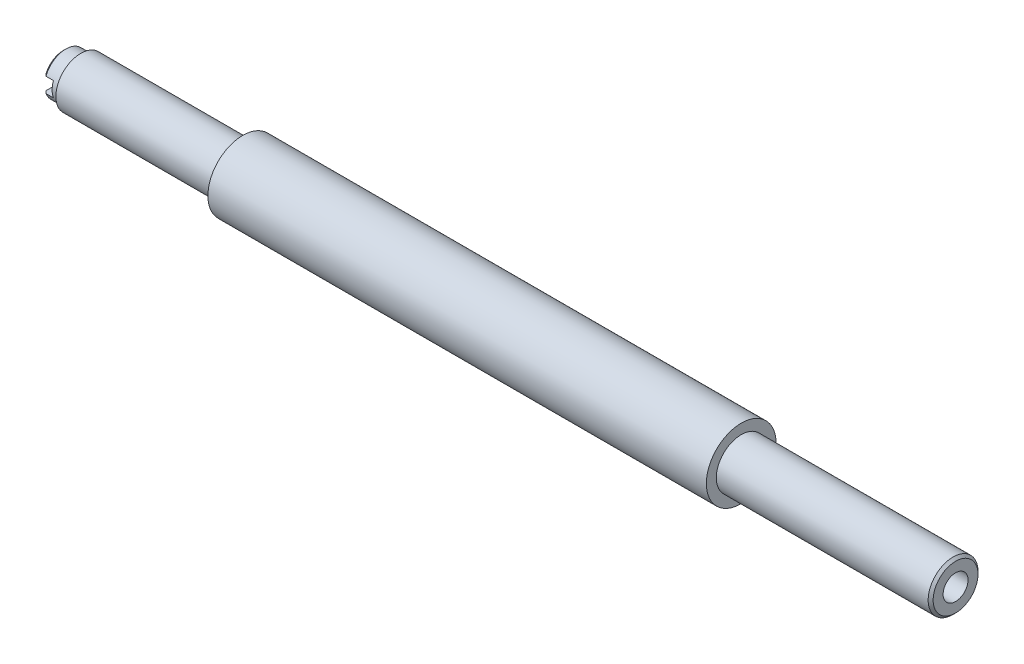
ISO-10303-21;
HEADER;
FILE_DESCRIPTION(('STEP AP214'),'2;1');
FILE_NAME('part.step','',(''),(''),'','','');
FILE_SCHEMA(('AUTOMOTIVE_DESIGN { 1 0 10303 214 1 1 1 1 }'));
ENDSEC;
DATA;
#1=APPLICATION_CONTEXT('core data for automotive mechanical design processes');
#2=APPLICATION_PROTOCOL_DEFINITION('international standard','automotive_design',2000,#1);
#3=PRODUCT_CONTEXT('',#1,'mechanical');
#4=PRODUCT('Part','Part','',(#3));
#5=PRODUCT_RELATED_PRODUCT_CATEGORY('part','',(#4));
#6=PRODUCT_DEFINITION_FORMATION('','',#4);
#7=PRODUCT_DEFINITION_CONTEXT('part definition',#1,'design');
#8=PRODUCT_DEFINITION('design','',#6,#7);
#9=PRODUCT_DEFINITION_SHAPE('','',#8);
#10=(LENGTH_UNIT() NAMED_UNIT(*) SI_UNIT(.MILLI.,.METRE.));
#11=(NAMED_UNIT(*) PLANE_ANGLE_UNIT() SI_UNIT($,.RADIAN.));
#12=(NAMED_UNIT(*) SI_UNIT($,.STERADIAN.) SOLID_ANGLE_UNIT());
#13=UNCERTAINTY_MEASURE_WITH_UNIT(LENGTH_MEASURE(1.E-05),#10,'distance_accuracy_value','');
#14=(GEOMETRIC_REPRESENTATION_CONTEXT(3) GLOBAL_UNCERTAINTY_ASSIGNED_CONTEXT((#13)) GLOBAL_UNIT_ASSIGNED_CONTEXT((#10,
#11,#12)) REPRESENTATION_CONTEXT('',''));
#15=CARTESIAN_POINT('',(0.,0.,0.));
#16=DIRECTION('',(0.,0.,1.));
#17=DIRECTION('',(1.,0.,0.));
#18=AXIS2_PLACEMENT_3D('',#15,#16,#17);
#19=CARTESIAN_POINT('',(-32.5,0.,0.));
#20=DIRECTION('',(-1.,0.,0.));
#21=DIRECTION('',(0.,0.,1.));
#22=AXIS2_PLACEMENT_3D('',#19,#20,#21);
#23=CYLINDRICAL_SURFACE('',#22,4.25);
#24=CARTESIAN_POINT('',(-32.5,0.,0.));
#25=DIRECTION('',(-1.,0.,0.));
#26=DIRECTION('',(0.,0.,1.));
#27=AXIS2_PLACEMENT_3D('',#24,#25,#26);
#28=CIRCLE('',#27,4.25);
#29=CARTESIAN_POINT('',(-32.5,0.,4.25));
#30=VERTEX_POINT('',#29);
#31=EDGE_CURVE('E130',#30,#30,#28,.T.);
#32=ORIENTED_EDGE('',*,*,#31,.T.);
#33=EDGE_LOOP('',(#32));
#34=FACE_BOUND('',#33,.T.);
#35=DIRECTION('',(-1.,0.,0.));
#36=VECTOR('',#35,1.);
#37=CARTESIAN_POINT('',(-32.5,-1.5,3.97649343014672));
#38=LINE('',#37,#36);
#39=CARTESIAN_POINT('',(-34.,-1.5,3.97649343014672));
#40=VERTEX_POINT('',#39);
#41=CARTESIAN_POINT('',(-35.5,-1.5,3.97649343014672));
#42=VERTEX_POINT('',#41);
#43=EDGE_CURVE('E278',#40,#42,#38,.T.);
#44=ORIENTED_EDGE('',*,*,#43,.T.);
#45=CARTESIAN_POINT('',(-35.5,0.,0.));
#46=DIRECTION('',(1.,0.,0.));
#47=DIRECTION('',(0.,0.,-1.));
#48=AXIS2_PLACEMENT_3D('',#45,#46,#47);
#49=CIRCLE('',#48,4.25);
#50=CARTESIAN_POINT('',(-35.5,1.5,3.97649343014672));
#51=VERTEX_POINT('',#50);
#52=EDGE_CURVE('E47',#42,#51,#49,.T.);
#53=ORIENTED_EDGE('',*,*,#52,.T.);
#54=DIRECTION('',(-1.,0.,0.));
#55=VECTOR('',#54,1.);
#56=CARTESIAN_POINT('',(-32.5,1.5,3.97649343014672));
#57=LINE('',#56,#55);
#58=CARTESIAN_POINT('',(-34.,1.5,3.97649343014672));
#59=VERTEX_POINT('',#58);
#60=EDGE_CURVE('E100',#51,#59,#57,.F.);
#61=ORIENTED_EDGE('',*,*,#60,.T.);
#62=CARTESIAN_POINT('',(-34.,0.,0.));
#63=DIRECTION('',(-1.,0.,0.));
#64=DIRECTION('',(0.,0.,1.));
#65=AXIS2_PLACEMENT_3D('',#62,#63,#64);
#66=CIRCLE('',#65,4.25);
#67=EDGE_CURVE('E280',#59,#40,#66,.F.);
#68=ORIENTED_EDGE('',*,*,#67,.T.);
#69=EDGE_LOOP('',(#44,#53,#61,#68));
#70=FACE_BOUND('',#69,.T.);
#71=ADVANCED_FACE('F32',(#34,#70),#23,.T.);
#72=CARTESIAN_POINT('',(-36.,0.,0.));
#73=DIRECTION('',(1.,0.,0.));
#74=DIRECTION('',(0.,0.,-1.));
#75=AXIS2_PLACEMENT_3D('',#72,#73,#74);
#76=CYLINDRICAL_SURFACE('',#75,2.5);
#77=CARTESIAN_POINT('',(0.,0.,0.));
#78=DIRECTION('',(1.,0.,0.));
#79=DIRECTION('',(0.,0.,-1.));
#80=AXIS2_PLACEMENT_3D('',#77,#78,#79);
#81=CIRCLE('',#80,2.5);
#82=CARTESIAN_POINT('',(0.,0.,-2.5));
#83=VERTEX_POINT('',#82);
#84=EDGE_CURVE('E118',#83,#83,#81,.T.);
#85=ORIENTED_EDGE('',*,*,#84,.T.);
#86=EDGE_LOOP('',(#85));
#87=FACE_BOUND('',#86,.T.);
#88=DIRECTION('',(1.,0.,0.));
#89=VECTOR('',#88,1.);
#90=CARTESIAN_POINT('',(-36.,-1.5,2.));
#91=LINE('',#90,#89);
#92=CARTESIAN_POINT('',(-34.,-1.5,2.));
#93=VERTEX_POINT('',#92);
#94=CARTESIAN_POINT('',(-36.,-1.5,2.));
#95=VERTEX_POINT('',#94);
#96=EDGE_CURVE('E276',#93,#95,#91,.F.);
#97=ORIENTED_EDGE('',*,*,#96,.F.);
#98=CARTESIAN_POINT('',(-34.,0.,0.));
#99=DIRECTION('',(-1.,0.,0.));
#100=DIRECTION('',(0.,0.,1.));
#101=AXIS2_PLACEMENT_3D('',#98,#99,#100);
#102=CIRCLE('',#101,2.5);
#103=CARTESIAN_POINT('',(-34.,1.5,2.));
#104=VERTEX_POINT('',#103);
#105=EDGE_CURVE('E99',#104,#93,#102,.F.);
#106=ORIENTED_EDGE('',*,*,#105,.F.);
#107=DIRECTION('',(1.,0.,0.));
#108=VECTOR('',#107,1.);
#109=CARTESIAN_POINT('',(-36.,1.5,2.));
#110=LINE('',#109,#108);
#111=CARTESIAN_POINT('',(-36.,1.5,2.));
#112=VERTEX_POINT('',#111);
#113=EDGE_CURVE('E82',#112,#104,#110,.T.);
#114=ORIENTED_EDGE('',*,*,#113,.F.);
#115=CARTESIAN_POINT('',(-36.,0.,0.));
#116=DIRECTION('',(1.,0.,0.));
#117=DIRECTION('',(0.,0.,-1.));
#118=AXIS2_PLACEMENT_3D('',#115,#116,#117);
#119=CIRCLE('',#118,2.5);
#120=EDGE_CURVE('E98',#95,#112,#119,.T.);
#121=ORIENTED_EDGE('',*,*,#120,.F.);
#122=EDGE_LOOP('',(#97,#106,#114,#121));
#123=FACE_BOUND('',#122,.T.);
#124=ADVANCED_FACE('F97',(#87,#123),#76,.F.);
#125=CARTESIAN_POINT('',(-36.,0.,0.));
#126=DIRECTION('',(1.,0.,0.));
#127=DIRECTION('',(0.,0.,-1.));
#128=AXIS2_PLACEMENT_3D('',#125,#126,#127);
#129=PLANE('',#128);
#130=DIRECTION('',(0.,0.,-1.));
#131=VECTOR('',#130,1.);
#132=CARTESIAN_POINT('',(-36.,1.5,0.));
#133=LINE('',#132,#131);
#134=CARTESIAN_POINT('',(-36.,1.5,3.43693177121682));
#135=VERTEX_POINT('',#134);
#136=EDGE_CURVE('E78',#135,#112,#133,.T.);
#137=ORIENTED_EDGE('',*,*,#136,.F.);
#138=CARTESIAN_POINT('',(-36.,0.,0.));
#139=DIRECTION('',(1.,0.,0.));
#140=DIRECTION('',(0.,0.,-1.));
#141=AXIS2_PLACEMENT_3D('',#138,#139,#140);
#142=CIRCLE('',#141,3.74999999999995);
#143=CARTESIAN_POINT('',(-36.,-1.5,3.43693177121682));
#144=VERTEX_POINT('',#143);
#145=EDGE_CURVE('E134',#135,#144,#142,.F.);
#146=ORIENTED_EDGE('',*,*,#145,.T.);
#147=DIRECTION('',(0.,0.,1.));
#148=VECTOR('',#147,1.);
#149=CARTESIAN_POINT('',(-36.,-1.5,0.));
#150=LINE('',#149,#148);
#151=EDGE_CURVE('E90',#95,#144,#150,.T.);
#152=ORIENTED_EDGE('',*,*,#151,.F.);
#153=ORIENTED_EDGE('',*,*,#120,.T.);
#154=EDGE_LOOP('',(#137,#146,#152,#153));
#155=FACE_BOUND('',#154,.T.);
#156=ADVANCED_FACE('F104',(#155),#129,.F.);
#157=CARTESIAN_POINT('',(-36.,0.,0.));
#158=DIRECTION('',(1.,0.,0.));
#159=DIRECTION('',(0.,0.,-1.));
#160=AXIS2_PLACEMENT_3D('',#157,#158,#159);
#161=CYLINDRICAL_SURFACE('',#160,5.);
#162=CARTESIAN_POINT('',(0.,0.,0.));
#163=DIRECTION('',(1.,0.,0.));
#164=DIRECTION('',(0.,0.,-1.));
#165=AXIS2_PLACEMENT_3D('',#162,#163,#164);
#166=CIRCLE('',#165,5.);
#167=CARTESIAN_POINT('',(0.,0.,-5.));
#168=VERTEX_POINT('',#167);
#169=EDGE_CURVE('E109',#168,#168,#166,.T.);
#170=ORIENTED_EDGE('',*,*,#169,.F.);
#171=EDGE_LOOP('',(#170));
#172=FACE_BOUND('',#171,.T.);
#173=CARTESIAN_POINT('',(-32.5,0.,0.));
#174=DIRECTION('',(-1.,0.,0.));
#175=DIRECTION('',(0.,0.,1.));
#176=AXIS2_PLACEMENT_3D('',#173,#174,#175);
#177=CIRCLE('',#176,5.);
#178=CARTESIAN_POINT('',(-32.5,0.,5.));
#179=VERTEX_POINT('',#178);
#180=EDGE_CURVE('E112',#179,#179,#177,.F.);
#181=ORIENTED_EDGE('',*,*,#180,.T.);
#182=EDGE_LOOP('',(#181));
#183=FACE_BOUND('',#182,.T.);
#184=ADVANCED_FACE('F194',(#172,#183),#161,.T.);
#185=CARTESIAN_POINT('',(100.,0.,0.));
#186=DIRECTION('',(-1.,0.,0.));
#187=DIRECTION('',(0.,0.,1.));
#188=AXIS2_PLACEMENT_3D('',#185,#186,#187);
#189=CYLINDRICAL_SURFACE('',#188,7.);
#190=CARTESIAN_POINT('',(100.,0.,0.));
#191=DIRECTION('',(1.,0.,0.));
#192=DIRECTION('',(0.,0.,-1.));
#193=AXIS2_PLACEMENT_3D('',#190,#191,#192);
#194=CIRCLE('',#193,7.);
#195=CARTESIAN_POINT('',(100.,0.,-7.));
#196=VERTEX_POINT('',#195);
#197=EDGE_CURVE('E122',#196,#196,#194,.T.);
#198=ORIENTED_EDGE('',*,*,#197,.F.);
#199=EDGE_LOOP('',(#198));
#200=FACE_BOUND('',#199,.T.);
#201=CARTESIAN_POINT('',(0.,0.,0.));
#202=DIRECTION('',(1.,0.,0.));
#203=DIRECTION('',(0.,0.,-1.));
#204=AXIS2_PLACEMENT_3D('',#201,#202,#203);
#205=CIRCLE('',#204,7.);
#206=CARTESIAN_POINT('',(0.,0.,-7.));
#207=VERTEX_POINT('',#206);
#208=EDGE_CURVE('E119',#207,#207,#205,.T.);
#209=ORIENTED_EDGE('',*,*,#208,.T.);
#210=EDGE_LOOP('',(#209));
#211=FACE_BOUND('',#210,.T.);
#212=ADVANCED_FACE('F34',(#200,#211),#189,.T.);
#213=CARTESIAN_POINT('',(100.,0.,0.));
#214=DIRECTION('',(1.,0.,0.));
#215=DIRECTION('',(0.,0.,-1.));
#216=AXIS2_PLACEMENT_3D('',#213,#214,#215);
#217=PLANE('',#216);
#218=CARTESIAN_POINT('',(100.,0.,0.));
#219=DIRECTION('',(1.,0.,0.));
#220=DIRECTION('',(0.,0.,-1.));
#221=AXIS2_PLACEMENT_3D('',#218,#219,#220);
#222=CIRCLE('',#221,5.);
#223=CARTESIAN_POINT('',(100.,0.,-5.));
#224=VERTEX_POINT('',#223);
#225=EDGE_CURVE('E91',#224,#224,#222,.T.);
#226=ORIENTED_EDGE('',*,*,#225,.F.);
#227=EDGE_LOOP('',(#226));
#228=FACE_BOUND('',#227,.T.);
#229=ORIENTED_EDGE('',*,*,#197,.T.);
#230=EDGE_LOOP('',(#229));
#231=FACE_BOUND('',#230,.T.);
#232=ADVANCED_FACE('F200',(#228,#231),#217,.T.);
#233=CARTESIAN_POINT('',(0.,0.,0.));
#234=DIRECTION('',(1.,0.,0.));
#235=DIRECTION('',(0.,0.,-1.));
#236=AXIS2_PLACEMENT_3D('',#233,#234,#235);
#237=PLANE('',#236);
#238=ORIENTED_EDGE('',*,*,#169,.T.);
#239=EDGE_LOOP('',(#238));
#240=FACE_BOUND('',#239,.T.);
#241=ORIENTED_EDGE('',*,*,#208,.F.);
#242=EDGE_LOOP('',(#241));
#243=FACE_BOUND('',#242,.T.);
#244=ADVANCED_FACE('F197',(#240,#243),#237,.F.);
#245=CARTESIAN_POINT('',(142.5,0.,0.));
#246=DIRECTION('',(1.,0.,0.));
#247=DIRECTION('',(0.,0.,-1.));
#248=AXIS2_PLACEMENT_3D('',#245,#246,#247);
#249=CIRCLE('',#248,5.);
#250=CARTESIAN_POINT('',(142.5,0.,-5.));
#251=VERTEX_POINT('',#250);
#252=EDGE_CURVE('E12',#251,#251,#249,.F.);
#253=ORIENTED_EDGE('',*,*,#252,.T.);
#254=EDGE_LOOP('',(#253));
#255=FACE_BOUND('',#254,.T.);
#256=ORIENTED_EDGE('',*,*,#225,.T.);
#257=EDGE_LOOP('',(#256));
#258=FACE_BOUND('',#257,.T.);
#259=ADVANCED_FACE('F191',(#255,#258),#161,.T.);
#260=CARTESIAN_POINT('',(100.,0.,0.));
#261=DIRECTION('',(1.,0.,0.));
#262=DIRECTION('',(0.,0.,-1.));
#263=AXIS2_PLACEMENT_3D('',#260,#261,#262);
#264=CIRCLE('',#263,2.5);
#265=CARTESIAN_POINT('',(100.,0.,-2.5));
#266=VERTEX_POINT('',#265);
#267=EDGE_CURVE('E105',#266,#266,#264,.T.);
#268=ORIENTED_EDGE('',*,*,#267,.F.);
#269=EDGE_LOOP('',(#268));
#270=FACE_BOUND('',#269,.T.);
#271=CARTESIAN_POINT('',(143.,0.,0.));
#272=DIRECTION('',(1.,0.,0.));
#273=DIRECTION('',(0.,0.,-1.));
#274=AXIS2_PLACEMENT_3D('',#271,#272,#273);
#275=CIRCLE('',#274,2.5);
#276=CARTESIAN_POINT('',(143.,0.,-2.5));
#277=VERTEX_POINT('',#276);
#278=EDGE_CURVE('E106',#277,#277,#275,.T.);
#279=ORIENTED_EDGE('',*,*,#278,.T.);
#280=EDGE_LOOP('',(#279));
#281=FACE_BOUND('',#280,.T.);
#282=ADVANCED_FACE('F179',(#270,#281),#76,.F.);
#283=CARTESIAN_POINT('',(143.,0.,0.));
#284=DIRECTION('',(1.,0.,0.));
#285=DIRECTION('',(0.,0.,-1.));
#286=AXIS2_PLACEMENT_3D('',#283,#284,#285);
#287=PLANE('',#286);
#288=CARTESIAN_POINT('',(143.,0.,0.));
#289=DIRECTION('',(1.,0.,0.));
#290=DIRECTION('',(0.,0.,-1.));
#291=AXIS2_PLACEMENT_3D('',#288,#289,#290);
#292=CIRCLE('',#291,4.49999999999995);
#293=CARTESIAN_POINT('',(143.,0.,-4.49999999999995));
#294=VERTEX_POINT('',#293);
#295=EDGE_CURVE('E40',#294,#294,#292,.T.);
#296=ORIENTED_EDGE('',*,*,#295,.T.);
#297=EDGE_LOOP('',(#296));
#298=FACE_BOUND('',#297,.T.);
#299=ORIENTED_EDGE('',*,*,#278,.F.);
#300=EDGE_LOOP('',(#299));
#301=FACE_BOUND('',#300,.T.);
#302=ADVANCED_FACE('F162',(#298,#301),#287,.T.);
#303=ORIENTED_EDGE('',*,*,#267,.T.);
#304=EDGE_LOOP('',(#303));
#305=FACE_BOUND('',#304,.T.);
#306=ADVANCED_FACE('F186',(#305),#217,.T.);
#307=CARTESIAN_POINT('',(-32.5,0.,0.));
#308=DIRECTION('',(-1.,0.,0.));
#309=DIRECTION('',(0.,0.,1.));
#310=AXIS2_PLACEMENT_3D('',#307,#308,#309);
#311=PLANE('',#310);
#312=ORIENTED_EDGE('',*,*,#180,.F.);
#313=EDGE_LOOP('',(#312));
#314=FACE_BOUND('',#313,.T.);
#315=ORIENTED_EDGE('',*,*,#31,.F.);
#316=EDGE_LOOP('',(#315));
#317=FACE_BOUND('',#316,.T.);
#318=ADVANCED_FACE('F182',(#314,#317),#311,.T.);
#319=ORIENTED_EDGE('',*,*,#84,.F.);
#320=EDGE_LOOP('',(#319));
#321=FACE_BOUND('',#320,.T.);
#322=ADVANCED_FACE('F185',(#321),#237,.F.);
#323=CARTESIAN_POINT('',(-34.,1.5,7.));
#324=DIRECTION('',(-1.,0.,0.));
#325=DIRECTION('',(0.,0.,1.));
#326=AXIS2_PLACEMENT_3D('',#323,#324,#325);
#327=PLANE('',#326);
#328=DIRECTION('',(0.,0.,-1.));
#329=VECTOR('',#328,1.);
#330=CARTESIAN_POINT('',(-34.,1.5,7.));
#331=LINE('',#330,#329);
#332=EDGE_CURVE('E288',#59,#104,#331,.T.);
#333=ORIENTED_EDGE('',*,*,#332,.T.);
#334=ORIENTED_EDGE('',*,*,#105,.T.);
#335=DIRECTION('',(0.,0.,-1.));
#336=VECTOR('',#335,1.);
#337=CARTESIAN_POINT('',(-34.,-1.5,7.));
#338=LINE('',#337,#336);
#339=EDGE_CURVE('E101',#40,#93,#338,.T.);
#340=ORIENTED_EDGE('',*,*,#339,.F.);
#341=ORIENTED_EDGE('',*,*,#67,.F.);
#342=EDGE_LOOP('',(#333,#334,#340,#341));
#343=FACE_BOUND('',#342,.T.);
#344=ADVANCED_FACE('F240',(#343),#327,.T.);
#345=CARTESIAN_POINT('',(-36.,-1.5,7.));
#346=DIRECTION('',(0.,1.,0.));
#347=DIRECTION('',(0.,0.,1.));
#348=AXIS2_PLACEMENT_3D('',#345,#346,#347);
#349=PLANE('',#348);
#350=ORIENTED_EDGE('',*,*,#151,.T.);
#351=CARTESIAN_POINT('',(-36.,-1.5,3.43693177121682));
#352=CARTESIAN_POINT('',(-35.958580375508,-1.5,3.48212364928454));
#353=CARTESIAN_POINT('',(-35.9170903919116,-1.5,3.52725096800026));
#354=CARTESIAN_POINT('',(-35.8339831251569,-1.5,3.617387695923));
#355=CARTESIAN_POINT('',(-35.7923658428382,-1.5,3.66239710590415));
#356=CARTESIAN_POINT('',(-35.7090168997175,-1.5,3.75230976834814));
#357=CARTESIAN_POINT('',(-35.6672852390472,-1.5,3.79721302093326));
#358=CARTESIAN_POINT('',(-35.5837178971023,-1.5,3.88692318686092));
#359=CARTESIAN_POINT('',(-35.541882215145,-1.5,3.93173009956775));
#360=CARTESIAN_POINT('',(-35.5,-1.5,3.97649343014671));
#361=B_SPLINE_CURVE_WITH_KNOTS('',3,(#351,#352,#353,#354,#355,#356,#357,#358,#359,#360),
.UNSPECIFIED.,.F.,.F.,(4,2,2,2,4),(0.,0.183904769605688,0.367808328749503,0.551711675960827,
0.735616232970621),.UNSPECIFIED.);
#362=EDGE_CURVE('E55',#144,#42,#361,.T.);
#363=ORIENTED_EDGE('',*,*,#362,.T.);
#364=ORIENTED_EDGE('',*,*,#43,.F.);
#365=ORIENTED_EDGE('',*,*,#339,.T.);
#366=ORIENTED_EDGE('',*,*,#96,.T.);
#367=EDGE_LOOP('',(#350,#363,#364,#365,#366));
#368=FACE_BOUND('',#367,.T.);
#369=ADVANCED_FACE('F143',(#368),#349,.T.);
#370=CARTESIAN_POINT('',(-36.,1.5,7.));
#371=DIRECTION('',(0.,-1.,0.));
#372=DIRECTION('',(0.,0.,-1.));
#373=AXIS2_PLACEMENT_3D('',#370,#371,#372);
#374=PLANE('',#373);
#375=ORIENTED_EDGE('',*,*,#60,.F.);
#376=CARTESIAN_POINT('',(-35.5,1.5,3.97649343014672));
#377=CARTESIAN_POINT('',(-35.541882215145,1.5,3.93173009956775));
#378=CARTESIAN_POINT('',(-35.5837178971023,1.5,3.88692318686092));
#379=CARTESIAN_POINT('',(-35.6672852390472,1.5,3.79721302093326));
#380=CARTESIAN_POINT('',(-35.7090168997175,1.5,3.75230976834814));
#381=CARTESIAN_POINT('',(-35.7923658428382,1.5,3.66239710590415));
#382=CARTESIAN_POINT('',(-35.8339831251569,1.5,3.617387695923));
#383=CARTESIAN_POINT('',(-35.9170903919116,1.5,3.52725096800026));
#384=CARTESIAN_POINT('',(-35.958580375508,1.5,3.48212364928454));
#385=CARTESIAN_POINT('',(-36.,1.5,3.43693177121683));
#386=B_SPLINE_CURVE_WITH_KNOTS('',3,(#376,#377,#378,#379,#380,#381,#382,#383,#384,#385),
.UNSPECIFIED.,.F.,.F.,(4,2,2,2,4),(0.,0.183904557009797,0.367807904221118,0.551711463364933,
0.73561623297062),.UNSPECIFIED.);
#387=EDGE_CURVE('E85',#51,#135,#386,.T.);
#388=ORIENTED_EDGE('',*,*,#387,.T.);
#389=ORIENTED_EDGE('',*,*,#136,.T.);
#390=ORIENTED_EDGE('',*,*,#113,.T.);
#391=ORIENTED_EDGE('',*,*,#332,.F.);
#392=EDGE_LOOP('',(#375,#388,#389,#390,#391));
#393=FACE_BOUND('',#392,.T.);
#394=ADVANCED_FACE('F80',(#393),#374,.T.);
#395=CARTESIAN_POINT('',(-36.,0.,0.));
#396=DIRECTION('',(1.,0.,0.));
#397=DIRECTION('',(0.,0.,-1.));
#398=AXIS2_PLACEMENT_3D('',#395,#396,#397);
#399=CONICAL_SURFACE('',#398,3.74999999999995,0.785398163397459);
#400=ORIENTED_EDGE('',*,*,#387,.F.);
#401=ORIENTED_EDGE('',*,*,#52,.F.);
#402=ORIENTED_EDGE('',*,*,#362,.F.);
#403=ORIENTED_EDGE('',*,*,#145,.F.);
#404=EDGE_LOOP('',(#400,#401,#402,#403));
#405=FACE_BOUND('',#404,.T.);
#406=ADVANCED_FACE('F147',(#405),#399,.T.);
#407=CARTESIAN_POINT('',(143.,0.,0.));
#408=DIRECTION('',(-1.,0.,0.));
#409=DIRECTION('',(0.,0.,1.));
#410=AXIS2_PLACEMENT_3D('',#407,#408,#409);
#411=CONICAL_SURFACE('',#410,4.49999999999995,0.785398163397472);
#412=ORIENTED_EDGE('',*,*,#252,.F.);
#413=EDGE_LOOP('',(#412));
#414=FACE_BOUND('',#413,.T.);
#415=ORIENTED_EDGE('',*,*,#295,.F.);
#416=EDGE_LOOP('',(#415));
#417=FACE_BOUND('',#416,.T.);
#418=ADVANCED_FACE('F152',(#414,#417),#411,.T.);
#419=CLOSED_SHELL('',(#71,#124,#156,#184,#212,#232,#244,#259,#282,#302,#306,#318,#322,#344,#369,
#394,#406,#418));
#420=MANIFOLD_SOLID_BREP('B2',#419);
#421=ADVANCED_BREP_SHAPE_REPRESENTATION('',(#18,#420),#14);
#422=SHAPE_DEFINITION_REPRESENTATION(#9,#421);
ENDSEC;
END-ISO-10303-21;
